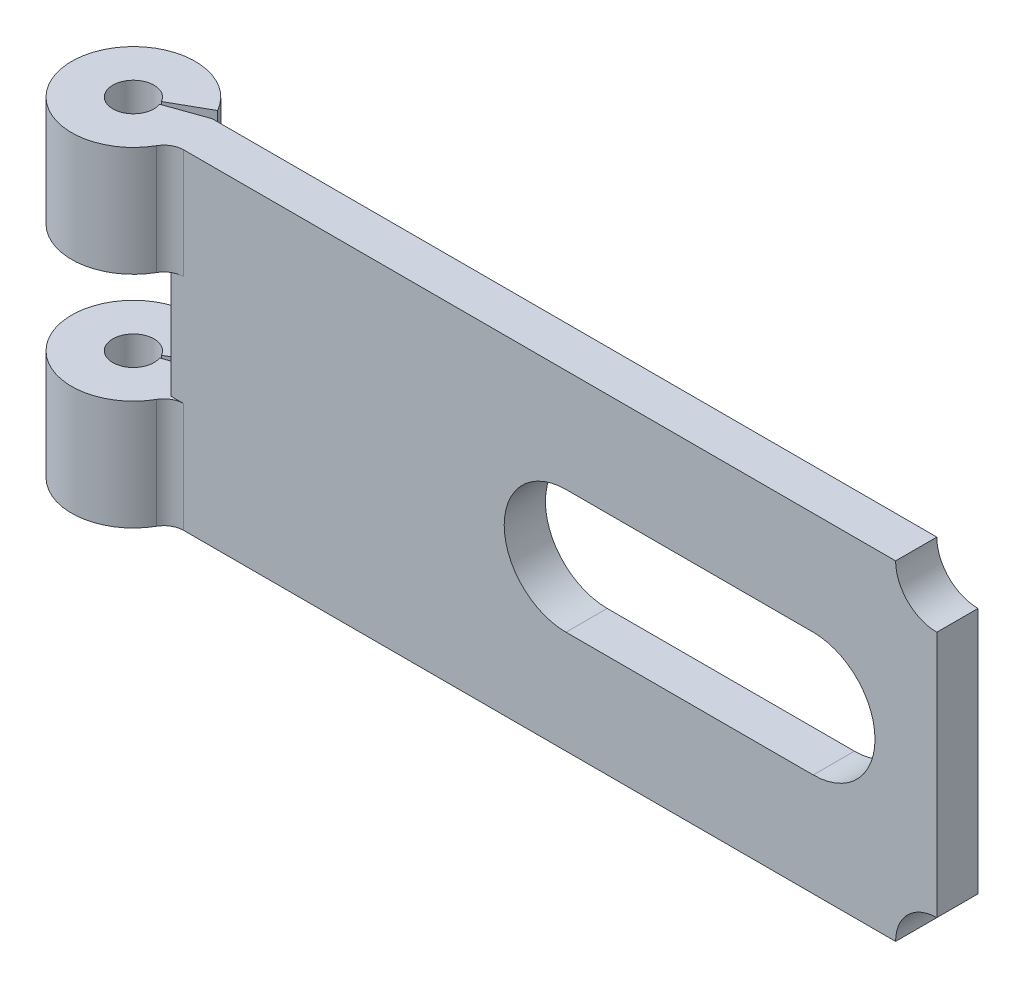
ISO-10303-21;
HEADER;
FILE_DESCRIPTION(('STEP AP214'),'2;1');
FILE_NAME('part.step','',(''),(''),'','','');
FILE_SCHEMA(('AUTOMOTIVE_DESIGN { 1 0 10303 214 1 1 1 1 }'));
ENDSEC;
DATA;
#1=APPLICATION_CONTEXT('core data for automotive mechanical design processes');
#2=APPLICATION_PROTOCOL_DEFINITION('international standard','automotive_design',2000,#1);
#3=PRODUCT_CONTEXT('',#1,'mechanical');
#4=PRODUCT('Part','Part','',(#3));
#5=PRODUCT_RELATED_PRODUCT_CATEGORY('part','',(#4));
#6=PRODUCT_DEFINITION_FORMATION('','',#4);
#7=PRODUCT_DEFINITION_CONTEXT('part definition',#1,'design');
#8=PRODUCT_DEFINITION('design','',#6,#7);
#9=PRODUCT_DEFINITION_SHAPE('','',#8);
#10=(LENGTH_UNIT() NAMED_UNIT(*) SI_UNIT(.MILLI.,.METRE.));
#11=(NAMED_UNIT(*) PLANE_ANGLE_UNIT() SI_UNIT($,.RADIAN.));
#12=(NAMED_UNIT(*) SI_UNIT($,.STERADIAN.) SOLID_ANGLE_UNIT());
#13=UNCERTAINTY_MEASURE_WITH_UNIT(LENGTH_MEASURE(1.E-05),#10,'distance_accuracy_value','');
#14=(GEOMETRIC_REPRESENTATION_CONTEXT(3) GLOBAL_UNCERTAINTY_ASSIGNED_CONTEXT((#13)) GLOBAL_UNIT_ASSIGNED_CONTEXT((#10,
#11,#12)) REPRESENTATION_CONTEXT('',''));
#15=CARTESIAN_POINT('',(0.,0.,0.));
#16=DIRECTION('',(0.,0.,1.));
#17=DIRECTION('',(1.,0.,0.));
#18=AXIS2_PLACEMENT_3D('',#15,#16,#17);
#19=CARTESIAN_POINT('',(-54.1111859697327,12.7,1.58750000000107));
#20=DIRECTION('',(0.333333333333335,0.,0.942809041582063));
#21=DIRECTION('',(0.942809041582063,0.,-0.333333333333335));
#22=AXIS2_PLACEMENT_3D('',#19,#20,#21);
#23=PLANE('',#22);
#24=DIRECTION('',(0.,-1.,0.));
#25=VECTOR('',#24,1.);
#26=CARTESIAN_POINT('',(-57.1046046767557,12.7,2.64583333333441));
#27=LINE('',#26,#25);
#28=CARTESIAN_POINT('',(-57.1046046767557,-4.23333333333333,2.64583333333441));
#29=VERTEX_POINT('',#28);
#30=CARTESIAN_POINT('',(-57.1046046767557,-12.7,2.64583333333441));
#31=VERTEX_POINT('',#30);
#32=EDGE_CURVE('E297',#29,#31,#27,.T.);
#33=ORIENTED_EDGE('',*,*,#32,.F.);
#34=DIRECTION('',(0.942809041582063,0.,-0.333333333333335));
#35=VECTOR('',#34,1.);
#36=CARTESIAN_POINT('',(-54.1111859697327,-4.23333333333333,1.58750000000107));
#37=LINE('',#36,#35);
#38=CARTESIAN_POINT('',(-54.1111859697327,-4.23333333333333,1.58750000000107));
#39=VERTEX_POINT('',#38);
#40=EDGE_CURVE('E246',#29,#39,#37,.T.);
#41=ORIENTED_EDGE('',*,*,#40,.T.);
#42=DIRECTION('',(0.,-1.,0.));
#43=VECTOR('',#42,1.);
#44=CARTESIAN_POINT('',(-54.1111859697327,12.7,1.58750000000107));
#45=LINE('',#44,#43);
#46=CARTESIAN_POINT('',(-54.1111859697327,-12.7,1.58750000000107));
#47=VERTEX_POINT('',#46);
#48=EDGE_CURVE('E264',#39,#47,#45,.T.);
#49=ORIENTED_EDGE('',*,*,#48,.T.);
#50=DIRECTION('',(-0.942809041582062,0.,0.333333333333335));
#51=VECTOR('',#50,1.);
#52=CARTESIAN_POINT('',(-54.1111859697327,-12.7,1.58750000000107));
#53=LINE('',#52,#51);
#54=EDGE_CURVE('E249',#47,#31,#53,.T.);
#55=ORIENTED_EDGE('',*,*,#54,.T.);
#56=EDGE_LOOP('',(#33,#41,#49,#55));
#57=FACE_BOUND('',#56,.T.);
#58=ADVANCED_FACE('F27',(#57),#23,.F.);
#59=CARTESIAN_POINT('',(-58.6013140302673,12.7,3.17500000000109));
#60=DIRECTION('',(0.,-1.,0.));
#61=DIRECTION('',(0.,0.,-1.));
#62=AXIS2_PLACEMENT_3D('',#59,#60,#61);
#63=CYLINDRICAL_SURFACE('',#62,1.58750000000002);
#64=DIRECTION('',(0.,-1.,0.));
#65=VECTOR('',#64,1.);
#66=CARTESIAN_POINT('',(-57.219231882272,12.7,2.39397171229779));
#67=LINE('',#66,#65);
#68=CARTESIAN_POINT('',(-57.219231882272,-4.23333333333333,2.39397171229779));
#69=VERTEX_POINT('',#68);
#70=CARTESIAN_POINT('',(-57.219231882272,-12.7,2.39397171229779));
#71=VERTEX_POINT('',#70);
#72=EDGE_CURVE('E293',#69,#71,#67,.T.);
#73=ORIENTED_EDGE('',*,*,#72,.F.);
#74=CARTESIAN_POINT('',(-58.6013140302673,-4.23333333333333,3.17500000000109));
#75=DIRECTION('',(0.,-1.,0.));
#76=DIRECTION('',(1.,0.,0.));
#77=AXIS2_PLACEMENT_3D('',#74,#75,#76);
#78=CIRCLE('',#77,1.58750000000002);
#79=EDGE_CURVE('E243',#69,#29,#78,.F.);
#80=ORIENTED_EDGE('',*,*,#79,.T.);
#81=ORIENTED_EDGE('',*,*,#32,.T.);
#82=CARTESIAN_POINT('',(-58.6013140302673,-12.7,3.17500000000109));
#83=DIRECTION('',(0.,-1.,0.));
#84=DIRECTION('',(0.,0.,1.));
#85=AXIS2_PLACEMENT_3D('',#82,#83,#84);
#86=CIRCLE('',#85,1.58750000000002);
#87=EDGE_CURVE('E267',#31,#71,#86,.T.);
#88=ORIENTED_EDGE('',*,*,#87,.T.);
#89=EDGE_LOOP('',(#73,#80,#81,#88));
#90=FACE_BOUND('',#89,.T.);
#91=ADVANCED_FACE('F416',(#90),#63,.F.);
#92=CARTESIAN_POINT('',(-54.4550675862814,12.7,0.83191513689121));
#93=DIRECTION('',(-0.491986322962703,0.,-0.870602927871047));
#94=DIRECTION('',(-0.870602927871047,0.,0.491986322962703));
#95=AXIS2_PLACEMENT_3D('',#92,#93,#94);
#96=PLANE('',#95);
#97=DIRECTION('',(0.,-1.,0.));
#98=VECTOR('',#97,1.);
#99=CARTESIAN_POINT('',(-54.4550675862814,12.7,0.831915136891211));
#100=LINE('',#99,#98);
#101=CARTESIAN_POINT('',(-54.4550675862814,-4.23333333333333,0.83191513689121));
#102=VERTEX_POINT('',#101);
#103=CARTESIAN_POINT('',(-54.4550675862814,-12.7,0.831915136891211));
#104=VERTEX_POINT('',#103);
#105=EDGE_CURVE('E289',#102,#104,#100,.T.);
#106=ORIENTED_EDGE('',*,*,#105,.F.);
#107=DIRECTION('',(-0.870602927871047,0.,0.491986322962703));
#108=VECTOR('',#107,1.);
#109=CARTESIAN_POINT('',(-54.4550675862814,-4.23333333333333,0.831915136891211));
#110=LINE('',#109,#108);
#111=EDGE_CURVE('E240',#102,#69,#110,.T.);
#112=ORIENTED_EDGE('',*,*,#111,.T.);
#113=ORIENTED_EDGE('',*,*,#72,.T.);
#114=DIRECTION('',(0.870602927871047,0.,-0.491986322962703));
#115=VECTOR('',#114,1.);
#116=CARTESIAN_POINT('',(-54.4550675862814,-12.7,0.83191513689121));
#117=LINE('',#116,#115);
#118=EDGE_CURVE('E270',#71,#104,#117,.T.);
#119=ORIENTED_EDGE('',*,*,#118,.T.);
#120=EDGE_LOOP('',(#106,#112,#113,#119));
#121=FACE_BOUND('',#120,.T.);
#122=ADVANCED_FACE('F393',(#121),#96,.F.);
#123=CARTESIAN_POINT('',(-58.6013140302673,12.7,3.17500000000109));
#124=DIRECTION('',(0.,-1.,0.));
#125=DIRECTION('',(0.,0.,-1.));
#126=AXIS2_PLACEMENT_3D('',#123,#124,#125);
#127=CYLINDRICAL_SURFACE('',#126,4.76250000000002);
#128=CARTESIAN_POINT('',(-58.6013140302673,-12.7,3.17500000000109));
#129=DIRECTION('',(0.,1.,0.));
#130=DIRECTION('',(0.,0.,1.));
#131=AXIS2_PLACEMENT_3D('',#128,#129,#130);
#132=CIRCLE('',#131,4.76250000000002);
#133=CARTESIAN_POINT('',(-54.4630742237733,-12.7,5.53219696969807));
#134=VERTEX_POINT('',#133);
#135=EDGE_CURVE('E273',#104,#134,#132,.T.);
#136=ORIENTED_EDGE('',*,*,#135,.T.);
#137=DIRECTION('',(0.,-1.,0.));
#138=VECTOR('',#137,1.);
#139=CARTESIAN_POINT('',(-54.4630742237733,12.7,5.53219696969807));
#140=LINE('',#139,#138);
#141=CARTESIAN_POINT('',(-54.4630742237733,-4.23333333333333,5.53219696969807));
#142=VERTEX_POINT('',#141);
#143=EDGE_CURVE('E329',#134,#142,#140,.F.);
#144=ORIENTED_EDGE('',*,*,#143,.T.);
#145=CARTESIAN_POINT('',(-58.6013140302673,-4.23333333333333,3.17500000000109));
#146=DIRECTION('',(0.,-1.,0.));
#147=DIRECTION('',(1.,0.,0.));
#148=AXIS2_PLACEMENT_3D('',#145,#146,#147);
#149=CIRCLE('',#148,4.76250000000002);
#150=EDGE_CURVE('E303',#142,#102,#149,.T.);
#151=ORIENTED_EDGE('',*,*,#150,.T.);
#152=ORIENTED_EDGE('',*,*,#105,.T.);
#153=EDGE_LOOP('',(#136,#144,#151,#152));
#154=FACE_BOUND('',#153,.T.);
#155=ADVANCED_FACE('F388',(#154),#127,.T.);
#156=CARTESIAN_POINT('',(-54.1111859697327,12.7,1.58750000000107));
#157=VERTEX_POINT('',#156);
#158=CARTESIAN_POINT('',(-54.1111859697327,4.23333333333333,1.58750000000107));
#159=VERTEX_POINT('',#158);
#160=EDGE_CURVE('E279',#157,#159,#45,.T.);
#161=ORIENTED_EDGE('',*,*,#160,.T.);
#162=DIRECTION('',(-0.942809041582063,0.,0.333333333333335));
#163=VECTOR('',#162,1.);
#164=CARTESIAN_POINT('',(-54.1111859697327,4.23333333333333,1.58750000000107));
#165=LINE('',#164,#163);
#166=CARTESIAN_POINT('',(-57.1046046767557,4.23333333333333,2.64583333333441));
#167=VERTEX_POINT('',#166);
#168=EDGE_CURVE('E237',#159,#167,#165,.T.);
#169=ORIENTED_EDGE('',*,*,#168,.T.);
#170=CARTESIAN_POINT('',(-57.1046046767557,12.7,2.64583333333441));
#171=VERTEX_POINT('',#170);
#172=EDGE_CURVE('E298',#171,#167,#27,.T.);
#173=ORIENTED_EDGE('',*,*,#172,.F.);
#174=DIRECTION('',(-0.942809041582062,0.,0.333333333333335));
#175=VECTOR('',#174,1.);
#176=CARTESIAN_POINT('',(-54.1111859697327,12.7,1.58750000000107));
#177=LINE('',#176,#175);
#178=EDGE_CURVE('E250',#157,#171,#177,.T.);
#179=ORIENTED_EDGE('',*,*,#178,.F.);
#180=EDGE_LOOP('',(#161,#169,#173,#179));
#181=FACE_BOUND('',#180,.T.);
#182=ADVANCED_FACE('F366',(#181),#23,.F.);
#183=ORIENTED_EDGE('',*,*,#172,.T.);
#184=CARTESIAN_POINT('',(-58.6013140302673,4.23333333333333,3.17500000000109));
#185=DIRECTION('',(0.,1.,0.));
#186=DIRECTION('',(-1.,0.,0.));
#187=AXIS2_PLACEMENT_3D('',#184,#185,#186);
#188=CIRCLE('',#187,1.58750000000002);
#189=CARTESIAN_POINT('',(-57.219231882272,4.23333333333333,2.39397171229779));
#190=VERTEX_POINT('',#189);
#191=EDGE_CURVE('E234',#167,#190,#188,.F.);
#192=ORIENTED_EDGE('',*,*,#191,.T.);
#193=CARTESIAN_POINT('',(-57.219231882272,12.7,2.39397171229779));
#194=VERTEX_POINT('',#193);
#195=EDGE_CURVE('E294',#194,#190,#67,.T.);
#196=ORIENTED_EDGE('',*,*,#195,.F.);
#197=CARTESIAN_POINT('',(-58.6013140302673,12.7,3.17500000000109));
#198=DIRECTION('',(0.,-1.,0.));
#199=DIRECTION('',(0.,0.,1.));
#200=AXIS2_PLACEMENT_3D('',#197,#198,#199);
#201=CIRCLE('',#200,1.58750000000002);
#202=EDGE_CURVE('E253',#171,#194,#201,.T.);
#203=ORIENTED_EDGE('',*,*,#202,.F.);
#204=EDGE_LOOP('',(#183,#192,#196,#203));
#205=FACE_BOUND('',#204,.T.);
#206=ADVANCED_FACE('F369',(#205),#63,.F.);
#207=ORIENTED_EDGE('',*,*,#195,.T.);
#208=DIRECTION('',(0.870602927871047,0.,-0.491986322962703));
#209=VECTOR('',#208,1.);
#210=CARTESIAN_POINT('',(-54.4550675862814,4.23333333333333,0.83191513689121));
#211=LINE('',#210,#209);
#212=CARTESIAN_POINT('',(-54.4550675862814,4.23333333333333,0.83191513689121));
#213=VERTEX_POINT('',#212);
#214=EDGE_CURVE('E231',#190,#213,#211,.T.);
#215=ORIENTED_EDGE('',*,*,#214,.T.);
#216=CARTESIAN_POINT('',(-54.4550675862814,12.7,0.831915136891211));
#217=VERTEX_POINT('',#216);
#218=EDGE_CURVE('E290',#217,#213,#100,.T.);
#219=ORIENTED_EDGE('',*,*,#218,.F.);
#220=DIRECTION('',(0.870602927871047,0.,-0.491986322962703));
#221=VECTOR('',#220,1.);
#222=CARTESIAN_POINT('',(-54.4550675862814,12.7,0.83191513689121));
#223=LINE('',#222,#221);
#224=EDGE_CURVE('E256',#194,#217,#223,.T.);
#225=ORIENTED_EDGE('',*,*,#224,.F.);
#226=EDGE_LOOP('',(#207,#215,#219,#225));
#227=FACE_BOUND('',#226,.T.);
#228=ADVANCED_FACE('F373',(#227),#96,.F.);
#229=CARTESIAN_POINT('',(-58.6013140302673,4.23333333333333,3.17500000000109));
#230=DIRECTION('',(0.,1.,0.));
#231=DIRECTION('',(-1.,0.,0.));
#232=AXIS2_PLACEMENT_3D('',#229,#230,#231);
#233=CIRCLE('',#232,4.76250000000002);
#234=CARTESIAN_POINT('',(-54.4630742237733,4.23333333333333,5.53219696969807));
#235=VERTEX_POINT('',#234);
#236=EDGE_CURVE('E301',#213,#235,#233,.T.);
#237=ORIENTED_EDGE('',*,*,#236,.T.);
#238=DIRECTION('',(0.,-1.,0.));
#239=VECTOR('',#238,1.);
#240=CARTESIAN_POINT('',(-54.4630742237733,12.7,5.53219696969807));
#241=LINE('',#240,#239);
#242=CARTESIAN_POINT('',(-54.4630742237733,12.7,5.53219696969807));
#243=VERTEX_POINT('',#242);
#244=EDGE_CURVE('E50',#235,#243,#241,.F.);
#245=ORIENTED_EDGE('',*,*,#244,.T.);
#246=CARTESIAN_POINT('',(-58.6013140302673,12.7,3.17500000000109));
#247=DIRECTION('',(0.,1.,0.));
#248=DIRECTION('',(0.,0.,1.));
#249=AXIS2_PLACEMENT_3D('',#246,#247,#248);
#250=CIRCLE('',#249,4.76250000000002);
#251=EDGE_CURVE('E258',#217,#243,#250,.T.);
#252=ORIENTED_EDGE('',*,*,#251,.F.);
#253=ORIENTED_EDGE('',*,*,#218,.T.);
#254=EDGE_LOOP('',(#237,#245,#252,#253));
#255=FACE_BOUND('',#254,.T.);
#256=ADVANCED_FACE('F340',(#255),#127,.T.);
#257=CARTESIAN_POINT('',(4.89868596973272,12.7,4.7625000000011));
#258=DIRECTION('',(0.,0.,-1.));
#259=DIRECTION('',(-1.,0.,0.));
#260=AXIS2_PLACEMENT_3D('',#257,#258,#259);
#261=PLANE('',#260);
#262=DIRECTION('',(-1.,0.,0.));
#263=VECTOR('',#262,1.);
#264=CARTESIAN_POINT('',(-4.62631403026727,4.7625,4.76250000000111));
#265=LINE('',#264,#263);
#266=CARTESIAN_POINT('',(-4.62631403026727,4.7625,4.7625000000011));
#267=VERTEX_POINT('',#266);
#268=CARTESIAN_POINT('',(-23.6763140302673,4.7625,4.76250000000111));
#269=VERTEX_POINT('',#268);
#270=EDGE_CURVE('E188',#267,#269,#265,.T.);
#271=ORIENTED_EDGE('',*,*,#270,.F.);
#272=CARTESIAN_POINT('',(-4.62631403026727,0.,4.76250000000111));
#273=DIRECTION('',(0.,0.,1.));
#274=DIRECTION('',(1.,0.,0.));
#275=AXIS2_PLACEMENT_3D('',#272,#273,#274);
#276=CIRCLE('',#275,4.7625);
#277=CARTESIAN_POINT('',(-4.62631403026727,-4.7625,4.76250000000111));
#278=VERTEX_POINT('',#277);
#279=EDGE_CURVE('E193',#278,#267,#276,.T.);
#280=ORIENTED_EDGE('',*,*,#279,.F.);
#281=DIRECTION('',(1.,0.,0.));
#282=VECTOR('',#281,1.);
#283=CARTESIAN_POINT('',(-4.62631403026727,-4.7625,4.76250000000111));
#284=LINE('',#283,#282);
#285=CARTESIAN_POINT('',(-23.6763140302673,-4.7625,4.76250000000111));
#286=VERTEX_POINT('',#285);
#287=EDGE_CURVE('E198',#286,#278,#284,.T.);
#288=ORIENTED_EDGE('',*,*,#287,.F.);
#289=CARTESIAN_POINT('',(-23.6763140302673,0.,4.76250000000111));
#290=DIRECTION('',(0.,0.,1.));
#291=DIRECTION('',(1.,0.,0.));
#292=AXIS2_PLACEMENT_3D('',#289,#290,#291);
#293=CIRCLE('',#292,4.7625);
#294=EDGE_CURVE('E177',#269,#286,#293,.T.);
#295=ORIENTED_EDGE('',*,*,#294,.F.);
#296=EDGE_LOOP('',(#271,#280,#288,#295));
#297=FACE_BOUND('',#296,.T.);
#298=DIRECTION('',(1.,0.,0.));
#299=VECTOR('',#298,1.);
#300=CARTESIAN_POINT('',(-63.3638140302673,-4.23333333333333,4.76250000000111));
#301=LINE('',#300,#299);
#302=CARTESIAN_POINT('',(-54.1111859697327,-4.23333333333333,4.76250000000111));
#303=VERTEX_POINT('',#302);
#304=CARTESIAN_POINT('',(-53.1388374856952,-4.23333333333333,4.76250000000111));
#305=VERTEX_POINT('',#304);
#306=EDGE_CURVE('E42',#303,#305,#301,.T.);
#307=ORIENTED_EDGE('',*,*,#306,.T.);
#308=DIRECTION('',(0.,1.,0.));
#309=VECTOR('',#308,1.);
#310=CARTESIAN_POINT('',(-53.1388374856952,-12.7,4.76250000000111));
#311=LINE('',#310,#309);
#312=CARTESIAN_POINT('',(-53.1388374856952,-12.7,4.76250000000111));
#313=VERTEX_POINT('',#312);
#314=EDGE_CURVE('E326',#305,#313,#311,.F.);
#315=ORIENTED_EDGE('',*,*,#314,.T.);
#316=DIRECTION('',(1.,0.,0.));
#317=VECTOR('',#316,1.);
#318=CARTESIAN_POINT('',(4.89868596973272,-12.7,4.7625000000011));
#319=LINE('',#318,#317);
#320=CARTESIAN_POINT('',(1.72368596973273,-12.7,4.7625000000011));
#321=VERTEX_POINT('',#320);
#322=EDGE_CURVE('E276',#313,#321,#319,.T.);
#323=ORIENTED_EDGE('',*,*,#322,.T.);
#324=CARTESIAN_POINT('',(4.89868596973272,-12.7,4.76250000000111));
#325=DIRECTION('',(0.,0.,1.));
#326=DIRECTION('',(-1.,0.,0.));
#327=AXIS2_PLACEMENT_3D('',#324,#325,#326);
#328=CIRCLE('',#327,3.175);
#329=CARTESIAN_POINT('',(4.89868596973272,-9.525,4.76250000000111));
#330=VERTEX_POINT('',#329);
#331=EDGE_CURVE('E205',#330,#321,#328,.T.);
#332=ORIENTED_EDGE('',*,*,#331,.F.);
#333=DIRECTION('',(0.,-1.,0.));
#334=VECTOR('',#333,1.);
#335=CARTESIAN_POINT('',(4.89868596973272,12.7,4.7625000000011));
#336=LINE('',#335,#334);
#337=CARTESIAN_POINT('',(4.89868596973272,9.525,4.76250000000111));
#338=VERTEX_POINT('',#337);
#339=EDGE_CURVE('E286',#338,#330,#336,.T.);
#340=ORIENTED_EDGE('',*,*,#339,.F.);
#341=CARTESIAN_POINT('',(4.89868596973272,12.7,4.76250000000111));
#342=DIRECTION('',(0.,0.,1.));
#343=DIRECTION('',(1.,0.,0.));
#344=AXIS2_PLACEMENT_3D('',#341,#342,#343);
#345=CIRCLE('',#344,3.175);
#346=CARTESIAN_POINT('',(1.72368596973273,12.7,4.76250000000111));
#347=VERTEX_POINT('',#346);
#348=EDGE_CURVE('E215',#347,#338,#345,.T.);
#349=ORIENTED_EDGE('',*,*,#348,.F.);
#350=DIRECTION('',(1.,0.,0.));
#351=VECTOR('',#350,1.);
#352=CARTESIAN_POINT('',(4.89868596973272,12.7,4.7625000000011));
#353=LINE('',#352,#351);
#354=CARTESIAN_POINT('',(-53.1388374856952,12.7,4.76250000000111));
#355=VERTEX_POINT('',#354);
#356=EDGE_CURVE('E260',#355,#347,#353,.T.);
#357=ORIENTED_EDGE('',*,*,#356,.F.);
#358=DIRECTION('',(0.,1.,0.));
#359=VECTOR('',#358,1.);
#360=CARTESIAN_POINT('',(-53.1388374856952,4.23333333333333,4.76250000000111));
#361=LINE('',#360,#359);
#362=CARTESIAN_POINT('',(-53.1388374856952,4.23333333333333,4.76250000000111));
#363=VERTEX_POINT('',#362);
#364=EDGE_CURVE('E322',#355,#363,#361,.F.);
#365=ORIENTED_EDGE('',*,*,#364,.T.);
#366=DIRECTION('',(-1.,0.,0.));
#367=VECTOR('',#366,1.);
#368=CARTESIAN_POINT('',(-63.3638140302673,4.23333333333333,4.76250000000111));
#369=LINE('',#368,#367);
#370=CARTESIAN_POINT('',(-54.1111859697327,4.23333333333333,4.76250000000111));
#371=VERTEX_POINT('',#370);
#372=EDGE_CURVE('E320',#363,#371,#369,.T.);
#373=ORIENTED_EDGE('',*,*,#372,.T.);
#374=DIRECTION('',(0.,-1.,0.));
#375=VECTOR('',#374,1.);
#376=CARTESIAN_POINT('',(-54.1111859697327,12.7,4.76250000000111));
#377=LINE('',#376,#375);
#378=EDGE_CURVE('E227',#371,#303,#377,.T.);
#379=ORIENTED_EDGE('',*,*,#378,.T.);
#380=EDGE_LOOP('',(#307,#315,#323,#332,#340,#349,#357,#365,#373,#379));
#381=FACE_BOUND('',#380,.T.);
#382=ADVANCED_FACE('F195',(#297,#381),#261,.F.);
#383=CARTESIAN_POINT('',(4.89868596973272,12.7,1.58750000000108));
#384=DIRECTION('',(-1.,0.,0.));
#385=DIRECTION('',(0.,0.,1.));
#386=AXIS2_PLACEMENT_3D('',#383,#384,#385);
#387=PLANE('',#386);
#388=ORIENTED_EDGE('',*,*,#339,.T.);
#389=DIRECTION('',(0.,0.,1.));
#390=VECTOR('',#389,1.);
#391=CARTESIAN_POINT('',(4.89868596973272,-9.525,-1.58749999999893));
#392=LINE('',#391,#390);
#393=CARTESIAN_POINT('',(4.89868596973272,-9.525,1.58750000000108));
#394=VERTEX_POINT('',#393);
#395=EDGE_CURVE('E210',#394,#330,#392,.T.);
#396=ORIENTED_EDGE('',*,*,#395,.F.);
#397=DIRECTION('',(0.,-1.,0.));
#398=VECTOR('',#397,1.);
#399=CARTESIAN_POINT('',(4.89868596973272,12.7,1.58750000000108));
#400=LINE('',#399,#398);
#401=CARTESIAN_POINT('',(4.89868596973272,9.525,1.58750000000108));
#402=VERTEX_POINT('',#401);
#403=EDGE_CURVE('E282',#402,#394,#400,.T.);
#404=ORIENTED_EDGE('',*,*,#403,.F.);
#405=DIRECTION('',(0.,0.,1.));
#406=VECTOR('',#405,1.);
#407=CARTESIAN_POINT('',(4.89868596973272,9.525,-1.58749999999893));
#408=LINE('',#407,#406);
#409=EDGE_CURVE('E217',#402,#338,#408,.T.);
#410=ORIENTED_EDGE('',*,*,#409,.T.);
#411=EDGE_LOOP('',(#388,#396,#404,#410));
#412=FACE_BOUND('',#411,.T.);
#413=ADVANCED_FACE('F354',(#412),#387,.F.);
#414=CARTESIAN_POINT('',(-54.1111859697327,12.7,1.58750000000107));
#415=DIRECTION('',(0.,0.,1.));
#416=DIRECTION('',(1.,0.,0.));
#417=AXIS2_PLACEMENT_3D('',#414,#415,#416);
#418=PLANE('',#417);
#419=DIRECTION('',(1.,0.,0.));
#420=VECTOR('',#419,1.);
#421=CARTESIAN_POINT('',(-54.1111859697327,-4.76250000000001,1.58750000000107));
#422=LINE('',#421,#420);
#423=CARTESIAN_POINT('',(-23.6763140302673,-4.7625,1.58750000000108));
#424=VERTEX_POINT('',#423);
#425=CARTESIAN_POINT('',(-4.62631403026727,-4.7625,1.58750000000108));
#426=VERTEX_POINT('',#425);
#427=EDGE_CURVE('E314',#424,#426,#422,.T.);
#428=ORIENTED_EDGE('',*,*,#427,.T.);
#429=CARTESIAN_POINT('',(-4.62631403026727,0.,1.58750000000108));
#430=DIRECTION('',(0.,0.,1.));
#431=DIRECTION('',(1.,0.,0.));
#432=AXIS2_PLACEMENT_3D('',#429,#430,#431);
#433=CIRCLE('',#432,4.7625);
#434=CARTESIAN_POINT('',(-4.62631403026727,4.7625,1.58750000000108));
#435=VERTEX_POINT('',#434);
#436=EDGE_CURVE('E317',#426,#435,#433,.T.);
#437=ORIENTED_EDGE('',*,*,#436,.T.);
#438=DIRECTION('',(-1.,0.,0.));
#439=VECTOR('',#438,1.);
#440=CARTESIAN_POINT('',(-54.1111859697327,4.76249999999999,1.58750000000107));
#441=LINE('',#440,#439);
#442=CARTESIAN_POINT('',(-23.6763140302673,4.7625,1.58750000000108));
#443=VERTEX_POINT('',#442);
#444=EDGE_CURVE('E311',#435,#443,#441,.T.);
#445=ORIENTED_EDGE('',*,*,#444,.T.);
#446=CARTESIAN_POINT('',(-23.6763140302673,0.,1.58750000000108));
#447=DIRECTION('',(0.,0.,1.));
#448=DIRECTION('',(1.,0.,0.));
#449=AXIS2_PLACEMENT_3D('',#446,#447,#448);
#450=CIRCLE('',#449,4.7625);
#451=EDGE_CURVE('E180',#443,#424,#450,.T.);
#452=ORIENTED_EDGE('',*,*,#451,.T.);
#453=EDGE_LOOP('',(#428,#437,#445,#452));
#454=FACE_BOUND('',#453,.T.);
#455=ORIENTED_EDGE('',*,*,#403,.T.);
#456=CARTESIAN_POINT('',(4.89868596973272,-12.7,1.58750000000108));
#457=DIRECTION('',(0.,0.,1.));
#458=DIRECTION('',(1.,0.,0.));
#459=AXIS2_PLACEMENT_3D('',#456,#457,#458);
#460=CIRCLE('',#459,3.175);
#461=CARTESIAN_POINT('',(1.72368596973273,-12.7,1.58750000000108));
#462=VERTEX_POINT('',#461);
#463=EDGE_CURVE('E212',#394,#462,#460,.T.);
#464=ORIENTED_EDGE('',*,*,#463,.T.);
#465=DIRECTION('',(-1.,0.,0.));
#466=VECTOR('',#465,1.);
#467=CARTESIAN_POINT('',(-54.1111859697327,-12.7,1.58750000000107));
#468=LINE('',#467,#466);
#469=EDGE_CURVE('E254',#462,#47,#468,.T.);
#470=ORIENTED_EDGE('',*,*,#469,.T.);
#471=ORIENTED_EDGE('',*,*,#48,.F.);
#472=EDGE_CURVE('E283',#159,#39,#45,.T.);
#473=ORIENTED_EDGE('',*,*,#472,.F.);
#474=ORIENTED_EDGE('',*,*,#160,.F.);
#475=DIRECTION('',(-1.,0.,0.));
#476=VECTOR('',#475,1.);
#477=CARTESIAN_POINT('',(-54.1111859697327,12.7,1.58750000000107));
#478=LINE('',#477,#476);
#479=CARTESIAN_POINT('',(1.72368596973271,12.7,1.58750000000108));
#480=VERTEX_POINT('',#479);
#481=EDGE_CURVE('E262',#480,#157,#478,.T.);
#482=ORIENTED_EDGE('',*,*,#481,.F.);
#483=CARTESIAN_POINT('',(4.89868596973272,12.7,1.58750000000108));
#484=DIRECTION('',(0.,0.,1.));
#485=DIRECTION('',(1.,0.,0.));
#486=AXIS2_PLACEMENT_3D('',#483,#484,#485);
#487=CIRCLE('',#486,3.175);
#488=EDGE_CURVE('E220',#480,#402,#487,.T.);
#489=ORIENTED_EDGE('',*,*,#488,.T.);
#490=EDGE_LOOP('',(#455,#464,#470,#471,#473,#474,#482,#489));
#491=FACE_BOUND('',#490,.T.);
#492=ADVANCED_FACE('F357',(#454,#491),#418,.F.);
#493=CARTESIAN_POINT('',(-58.6013140302673,12.7,3.17500000000109));
#494=DIRECTION('',(0.,1.,0.));
#495=DIRECTION('',(0.,0.,1.));
#496=AXIS2_PLACEMENT_3D('',#493,#494,#495);
#497=PLANE('',#496);
#498=DIRECTION('',(0.,0.,1.));
#499=VECTOR('',#498,1.);
#500=CARTESIAN_POINT('',(1.72368596973273,12.7,-1.58749999999893));
#501=LINE('',#500,#499);
#502=EDGE_CURVE('E305',#480,#347,#501,.T.);
#503=ORIENTED_EDGE('',*,*,#502,.F.);
#504=ORIENTED_EDGE('',*,*,#481,.T.);
#505=ORIENTED_EDGE('',*,*,#178,.T.);
#506=ORIENTED_EDGE('',*,*,#202,.T.);
#507=ORIENTED_EDGE('',*,*,#224,.T.);
#508=ORIENTED_EDGE('',*,*,#251,.T.);
#509=CARTESIAN_POINT('',(-53.1388374856952,12.7,6.28650000000111));
#510=DIRECTION('',(0.,1.,0.));
#511=DIRECTION('',(0.,0.,1.));
#512=AXIS2_PLACEMENT_3D('',#509,#510,#511);
#513=CIRCLE('',#512,1.524);
#514=EDGE_CURVE('E13',#243,#355,#513,.F.);
#515=ORIENTED_EDGE('',*,*,#514,.T.);
#516=ORIENTED_EDGE('',*,*,#356,.T.);
#517=EDGE_LOOP('',(#503,#504,#505,#506,#507,#508,#515,#516));
#518=FACE_BOUND('',#517,.T.);
#519=ADVANCED_FACE('F346',(#518),#497,.T.);
#520=CARTESIAN_POINT('',(-58.6013140302673,-12.7,3.17500000000109));
#521=DIRECTION('',(0.,1.,0.));
#522=DIRECTION('',(0.,0.,1.));
#523=AXIS2_PLACEMENT_3D('',#520,#521,#522);
#524=PLANE('',#523);
#525=ORIENTED_EDGE('',*,*,#469,.F.);
#526=DIRECTION('',(0.,0.,1.));
#527=VECTOR('',#526,1.);
#528=CARTESIAN_POINT('',(1.72368596973273,-12.7,-1.58749999999893));
#529=LINE('',#528,#527);
#530=EDGE_CURVE('E308',#462,#321,#529,.T.);
#531=ORIENTED_EDGE('',*,*,#530,.T.);
#532=ORIENTED_EDGE('',*,*,#322,.F.);
#533=CARTESIAN_POINT('',(-53.1388374856952,-12.7,6.28650000000111));
#534=DIRECTION('',(0.,1.,0.));
#535=DIRECTION('',(0.,0.,1.));
#536=AXIS2_PLACEMENT_3D('',#533,#534,#535);
#537=CIRCLE('',#536,1.524);
#538=EDGE_CURVE('E332',#313,#134,#537,.T.);
#539=ORIENTED_EDGE('',*,*,#538,.T.);
#540=ORIENTED_EDGE('',*,*,#135,.F.);
#541=ORIENTED_EDGE('',*,*,#118,.F.);
#542=ORIENTED_EDGE('',*,*,#87,.F.);
#543=ORIENTED_EDGE('',*,*,#54,.F.);
#544=EDGE_LOOP('',(#525,#531,#532,#539,#540,#541,#542,#543));
#545=FACE_BOUND('',#544,.T.);
#546=ADVANCED_FACE('F385',(#545),#524,.F.);
#547=CARTESIAN_POINT('',(-63.3638140302673,-4.23333333333333,-1.58749999999893));
#548=DIRECTION('',(0.,-1.,0.));
#549=DIRECTION('',(1.,0.,0.));
#550=AXIS2_PLACEMENT_3D('',#547,#548,#549);
#551=PLANE('',#550);
#552=ORIENTED_EDGE('',*,*,#79,.F.);
#553=ORIENTED_EDGE('',*,*,#111,.F.);
#554=ORIENTED_EDGE('',*,*,#150,.F.);
#555=CARTESIAN_POINT('',(-53.1388374856952,-4.23333333333333,6.28650000000111));
#556=DIRECTION('',(0.,-1.,0.));
#557=DIRECTION('',(1.,0.,0.));
#558=AXIS2_PLACEMENT_3D('',#555,#556,#557);
#559=CIRCLE('',#558,1.524);
#560=EDGE_CURVE('E334',#142,#305,#559,.T.);
#561=ORIENTED_EDGE('',*,*,#560,.T.);
#562=ORIENTED_EDGE('',*,*,#306,.F.);
#563=DIRECTION('',(0.,0.,1.));
#564=VECTOR('',#563,1.);
#565=CARTESIAN_POINT('',(-54.1111859697327,-4.23333333333333,-1.58749999999893));
#566=LINE('',#565,#564);
#567=EDGE_CURVE('E224',#39,#303,#566,.T.);
#568=ORIENTED_EDGE('',*,*,#567,.F.);
#569=ORIENTED_EDGE('',*,*,#40,.F.);
#570=EDGE_LOOP('',(#552,#553,#554,#561,#562,#568,#569));
#571=FACE_BOUND('',#570,.T.);
#572=ADVANCED_FACE('F518',(#571),#551,.F.);
#573=CARTESIAN_POINT('',(-63.3638140302673,4.23333333333333,-1.58749999999893));
#574=DIRECTION('',(0.,1.,0.));
#575=DIRECTION('',(-1.,0.,0.));
#576=AXIS2_PLACEMENT_3D('',#573,#574,#575);
#577=PLANE('',#576);
#578=ORIENTED_EDGE('',*,*,#236,.F.);
#579=ORIENTED_EDGE('',*,*,#214,.F.);
#580=ORIENTED_EDGE('',*,*,#191,.F.);
#581=ORIENTED_EDGE('',*,*,#168,.F.);
#582=DIRECTION('',(0.,0.,1.));
#583=VECTOR('',#582,1.);
#584=CARTESIAN_POINT('',(-54.1111859697327,4.23333333333333,-1.58749999999893));
#585=LINE('',#584,#583);
#586=EDGE_CURVE('E223',#159,#371,#585,.T.);
#587=ORIENTED_EDGE('',*,*,#586,.T.);
#588=ORIENTED_EDGE('',*,*,#372,.F.);
#589=CARTESIAN_POINT('',(-53.1388374856952,4.23333333333333,6.28650000000111));
#590=DIRECTION('',(0.,1.,0.));
#591=DIRECTION('',(-1.,0.,0.));
#592=AXIS2_PLACEMENT_3D('',#589,#590,#591);
#593=CIRCLE('',#592,1.524);
#594=EDGE_CURVE('E35',#363,#235,#593,.T.);
#595=ORIENTED_EDGE('',*,*,#594,.T.);
#596=EDGE_LOOP('',(#578,#579,#580,#581,#587,#588,#595));
#597=FACE_BOUND('',#596,.T.);
#598=ADVANCED_FACE('F337',(#597),#577,.F.);
#599=CARTESIAN_POINT('',(-54.1111859697327,4.23333333333333,-1.58749999999893));
#600=DIRECTION('',(1.,0.,0.));
#601=DIRECTION('',(0.,0.,-1.));
#602=AXIS2_PLACEMENT_3D('',#599,#600,#601);
#603=PLANE('',#602);
#604=ORIENTED_EDGE('',*,*,#586,.F.);
#605=ORIENTED_EDGE('',*,*,#472,.T.);
#606=ORIENTED_EDGE('',*,*,#567,.T.);
#607=ORIENTED_EDGE('',*,*,#378,.F.);
#608=EDGE_LOOP('',(#604,#605,#606,#607));
#609=FACE_BOUND('',#608,.T.);
#610=ADVANCED_FACE('F376',(#609),#603,.F.);
#611=CARTESIAN_POINT('',(4.89868596973272,12.7,-1.58749999999893));
#612=DIRECTION('',(0.,0.,1.));
#613=DIRECTION('',(1.,0.,0.));
#614=AXIS2_PLACEMENT_3D('',#611,#612,#613);
#615=CYLINDRICAL_SURFACE('',#614,3.175);
#616=ORIENTED_EDGE('',*,*,#502,.T.);
#617=ORIENTED_EDGE('',*,*,#348,.T.);
#618=ORIENTED_EDGE('',*,*,#409,.F.);
#619=ORIENTED_EDGE('',*,*,#488,.F.);
#620=EDGE_LOOP('',(#616,#617,#618,#619));
#621=FACE_BOUND('',#620,.T.);
#622=ADVANCED_FACE('F351',(#621),#615,.F.);
#623=CARTESIAN_POINT('',(4.89868596973272,-12.7,-1.58749999999893));
#624=DIRECTION('',(0.,0.,1.));
#625=DIRECTION('',(1.,0.,0.));
#626=AXIS2_PLACEMENT_3D('',#623,#624,#625);
#627=CYLINDRICAL_SURFACE('',#626,3.175);
#628=ORIENTED_EDGE('',*,*,#395,.T.);
#629=ORIENTED_EDGE('',*,*,#331,.T.);
#630=ORIENTED_EDGE('',*,*,#530,.F.);
#631=ORIENTED_EDGE('',*,*,#463,.F.);
#632=EDGE_LOOP('',(#628,#629,#630,#631));
#633=FACE_BOUND('',#632,.T.);
#634=ADVANCED_FACE('F402',(#633),#627,.F.);
#635=CARTESIAN_POINT('',(-4.62631403026727,0.,-1.58749999999893));
#636=DIRECTION('',(0.,0.,1.));
#637=DIRECTION('',(1.,0.,0.));
#638=AXIS2_PLACEMENT_3D('',#635,#636,#637);
#639=CYLINDRICAL_SURFACE('',#638,4.7625);
#640=DIRECTION('',(0.,0.,1.));
#641=VECTOR('',#640,1.);
#642=CARTESIAN_POINT('',(-4.62631403026727,-4.7625,-1.58749999999893));
#643=LINE('',#642,#641);
#644=EDGE_CURVE('E203',#426,#278,#643,.T.);
#645=ORIENTED_EDGE('',*,*,#644,.T.);
#646=ORIENTED_EDGE('',*,*,#279,.T.);
#647=DIRECTION('',(0.,0.,1.));
#648=VECTOR('',#647,1.);
#649=CARTESIAN_POINT('',(-4.62631403026727,4.7625,-1.58749999999893));
#650=LINE('',#649,#648);
#651=EDGE_CURVE('E184',#435,#267,#650,.T.);
#652=ORIENTED_EDGE('',*,*,#651,.F.);
#653=ORIENTED_EDGE('',*,*,#436,.F.);
#654=EDGE_LOOP('',(#645,#646,#652,#653));
#655=FACE_BOUND('',#654,.T.);
#656=ADVANCED_FACE('F404',(#655),#639,.F.);
#657=CARTESIAN_POINT('',(-4.62631403026727,-4.7625,-1.58749999999893));
#658=DIRECTION('',(0.,-1.,0.));
#659=DIRECTION('',(1.,0.,0.));
#660=AXIS2_PLACEMENT_3D('',#657,#658,#659);
#661=PLANE('',#660);
#662=DIRECTION('',(0.,0.,1.));
#663=VECTOR('',#662,1.);
#664=CARTESIAN_POINT('',(-23.6763140302673,-4.7625,-1.58749999999893));
#665=LINE('',#664,#663);
#666=EDGE_CURVE('E183',#424,#286,#665,.T.);
#667=ORIENTED_EDGE('',*,*,#666,.T.);
#668=ORIENTED_EDGE('',*,*,#287,.T.);
#669=ORIENTED_EDGE('',*,*,#644,.F.);
#670=ORIENTED_EDGE('',*,*,#427,.F.);
#671=EDGE_LOOP('',(#667,#668,#669,#670));
#672=FACE_BOUND('',#671,.T.);
#673=ADVANCED_FACE('F411',(#672),#661,.F.);
#674=CARTESIAN_POINT('',(-23.6763140302673,0.,-1.58749999999893));
#675=DIRECTION('',(0.,0.,1.));
#676=DIRECTION('',(1.,0.,0.));
#677=AXIS2_PLACEMENT_3D('',#674,#675,#676);
#678=CYLINDRICAL_SURFACE('',#677,4.7625);
#679=DIRECTION('',(0.,0.,1.));
#680=VECTOR('',#679,1.);
#681=CARTESIAN_POINT('',(-23.6763140302673,4.7625,-1.58749999999893));
#682=LINE('',#681,#680);
#683=EDGE_CURVE('E172',#443,#269,#682,.T.);
#684=ORIENTED_EDGE('',*,*,#683,.T.);
#685=ORIENTED_EDGE('',*,*,#294,.T.);
#686=ORIENTED_EDGE('',*,*,#666,.F.);
#687=ORIENTED_EDGE('',*,*,#451,.F.);
#688=EDGE_LOOP('',(#684,#685,#686,#687));
#689=FACE_BOUND('',#688,.T.);
#690=ADVANCED_FACE('F174',(#689),#678,.F.);
#691=CARTESIAN_POINT('',(-4.62631403026727,4.7625,-1.58749999999893));
#692=DIRECTION('',(0.,1.,0.));
#693=DIRECTION('',(-1.,0.,0.));
#694=AXIS2_PLACEMENT_3D('',#691,#692,#693);
#695=PLANE('',#694);
#696=ORIENTED_EDGE('',*,*,#651,.T.);
#697=ORIENTED_EDGE('',*,*,#270,.T.);
#698=ORIENTED_EDGE('',*,*,#683,.F.);
#699=ORIENTED_EDGE('',*,*,#444,.F.);
#700=EDGE_LOOP('',(#696,#697,#698,#699));
#701=FACE_BOUND('',#700,.T.);
#702=ADVANCED_FACE('F189',(#701),#695,.F.);
#703=CARTESIAN_POINT('',(-53.1388374856952,12.7,6.28650000000111));
#704=DIRECTION('',(0.,-1.,0.));
#705=DIRECTION('',(0.,0.,-1.));
#706=AXIS2_PLACEMENT_3D('',#703,#704,#705);
#707=CYLINDRICAL_SURFACE('',#706,1.524);
#708=ORIENTED_EDGE('',*,*,#560,.F.);
#709=ORIENTED_EDGE('',*,*,#143,.F.);
#710=ORIENTED_EDGE('',*,*,#538,.F.);
#711=ORIENTED_EDGE('',*,*,#314,.F.);
#712=EDGE_LOOP('',(#708,#709,#710,#711));
#713=FACE_BOUND('',#712,.T.);
#714=ADVANCED_FACE('F381',(#713),#707,.F.);
#715=CARTESIAN_POINT('',(-53.1388374856952,12.7,6.28650000000111));
#716=DIRECTION('',(0.,-1.,0.));
#717=DIRECTION('',(0.,0.,-1.));
#718=AXIS2_PLACEMENT_3D('',#715,#716,#717);
#719=CYLINDRICAL_SURFACE('',#718,1.524);
#720=ORIENTED_EDGE('',*,*,#514,.F.);
#721=ORIENTED_EDGE('',*,*,#244,.F.);
#722=ORIENTED_EDGE('',*,*,#594,.F.);
#723=ORIENTED_EDGE('',*,*,#364,.F.);
#724=EDGE_LOOP('',(#720,#721,#722,#723));
#725=FACE_BOUND('',#724,.T.);
#726=ADVANCED_FACE('F29',(#725),#719,.F.);
#727=CLOSED_SHELL('',(#58,#91,#122,#155,#182,#206,#228,#256,#382,#413,#492,#519,#546,#572,#598,
#610,#622,#634,#656,#673,#690,#702,#714,#726));
#728=MANIFOLD_SOLID_BREP('B1',#727);
#729=ADVANCED_BREP_SHAPE_REPRESENTATION('',(#18,#728),#14);
#730=SHAPE_DEFINITION_REPRESENTATION(#9,#729);
ENDSEC;
END-ISO-10303-21;
